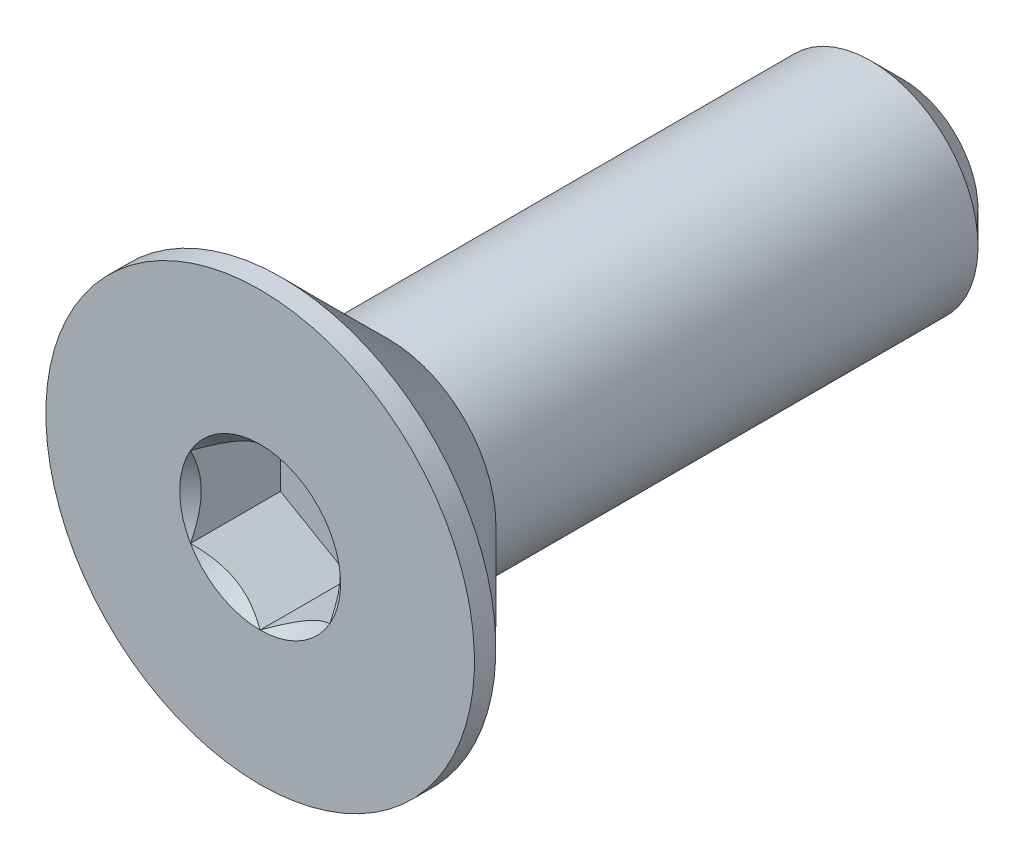
ISO-10303-21;
HEADER;
FILE_DESCRIPTION(('STEP AP214'),'2;1');
FILE_NAME('part.step','',(''),(''),'','','');
FILE_SCHEMA(('AUTOMOTIVE_DESIGN { 1 0 10303 214 1 1 1 1 }'));
ENDSEC;
DATA;
#1=APPLICATION_CONTEXT('core data for automotive mechanical design processes');
#2=APPLICATION_PROTOCOL_DEFINITION('international standard','automotive_design',2000,#1);
#3=PRODUCT_CONTEXT('',#1,'mechanical');
#4=PRODUCT('Part','Part','',(#3));
#5=PRODUCT_RELATED_PRODUCT_CATEGORY('part','',(#4));
#6=PRODUCT_DEFINITION_FORMATION('','',#4);
#7=PRODUCT_DEFINITION_CONTEXT('part definition',#1,'design');
#8=PRODUCT_DEFINITION('design','',#6,#7);
#9=PRODUCT_DEFINITION_SHAPE('','',#8);
#10=(LENGTH_UNIT() NAMED_UNIT(*) SI_UNIT(.MILLI.,.METRE.));
#11=(NAMED_UNIT(*) PLANE_ANGLE_UNIT() SI_UNIT($,.RADIAN.));
#12=(NAMED_UNIT(*) SI_UNIT($,.STERADIAN.) SOLID_ANGLE_UNIT());
#13=UNCERTAINTY_MEASURE_WITH_UNIT(LENGTH_MEASURE(1.E-05),#10,'distance_accuracy_value','');
#14=(GEOMETRIC_REPRESENTATION_CONTEXT(3) GLOBAL_UNCERTAINTY_ASSIGNED_CONTEXT((#13)) GLOBAL_UNIT_ASSIGNED_CONTEXT((#10,
#11,#12)) REPRESENTATION_CONTEXT('',''));
#15=CARTESIAN_POINT('',(0.,0.,0.));
#16=DIRECTION('',(0.,0.,1.));
#17=DIRECTION('',(1.,0.,0.));
#18=AXIS2_PLACEMENT_3D('',#15,#16,#17);
#19=CARTESIAN_POINT('',(0.,0.,-6.));
#20=DIRECTION('',(0.,0.,-1.));
#21=DIRECTION('',(0.,1.,0.));
#22=AXIS2_PLACEMENT_3D('',#19,#20,#21);
#23=CYLINDRICAL_SURFACE('',#22,0.999999999999998);
#24=CARTESIAN_POINT('',(0.,0.,-5.7));
#25=DIRECTION('',(0.,0.,-1.));
#26=DIRECTION('',(0.,1.,0.));
#27=AXIS2_PLACEMENT_3D('',#24,#25,#26);
#28=CIRCLE('',#27,0.999999999999998);
#29=CARTESIAN_POINT('',(0.,0.999999999999997,-5.7));
#30=VERTEX_POINT('',#29);
#31=EDGE_CURVE('E48',#30,#30,#28,.F.);
#32=ORIENTED_EDGE('',*,*,#31,.T.);
#33=EDGE_LOOP('',(#32));
#34=FACE_BOUND('',#33,.T.);
#35=CARTESIAN_POINT('',(0.,0.,-1.19999999999999));
#36=DIRECTION('',(0.,0.,1.));
#37=DIRECTION('',(0.,-1.,0.));
#38=AXIS2_PLACEMENT_3D('',#35,#36,#37);
#39=CIRCLE('',#38,1.00000000000001);
#40=CARTESIAN_POINT('',(0.,-1.00000000000001,-1.19999999999999));
#41=VERTEX_POINT('',#40);
#42=EDGE_CURVE('E166',#41,#41,#39,.T.);
#43=ORIENTED_EDGE('',*,*,#42,.F.);
#44=EDGE_LOOP('',(#43));
#45=FACE_BOUND('',#44,.T.);
#46=ADVANCED_FACE('F35',(#34,#45),#23,.T.);
#47=CARTESIAN_POINT('',(0.,-1.,-6.));
#48=DIRECTION('',(0.,0.,-1.));
#49=DIRECTION('',(0.,1.,0.));
#50=AXIS2_PLACEMENT_3D('',#47,#48,#49);
#51=PLANE('',#50);
#52=CARTESIAN_POINT('',(0.,0.,-6.));
#53=DIRECTION('',(0.,0.,-1.));
#54=DIRECTION('',(0.,1.,0.));
#55=AXIS2_PLACEMENT_3D('',#52,#53,#54);
#56=CIRCLE('',#55,0.700000000000001);
#57=CARTESIAN_POINT('',(0.,0.700000000000001,-6.));
#58=VERTEX_POINT('',#57);
#59=EDGE_CURVE('E175',#58,#58,#56,.T.);
#60=ORIENTED_EDGE('',*,*,#59,.T.);
#61=EDGE_LOOP('',(#60));
#62=FACE_BOUND('',#61,.T.);
#63=ADVANCED_FACE('F185',(#62),#51,.T.);
#64=CARTESIAN_POINT('',(0.,0.,-6.));
#65=DIRECTION('',(0.,0.,1.));
#66=DIRECTION('',(0.,-1.,0.));
#67=AXIS2_PLACEMENT_3D('',#64,#65,#66);
#68=CONICAL_SURFACE('',#67,0.700000000000001,0.785398163397446);
#69=ORIENTED_EDGE('',*,*,#31,.F.);
#70=EDGE_LOOP('',(#69));
#71=FACE_BOUND('',#70,.T.);
#72=ORIENTED_EDGE('',*,*,#59,.F.);
#73=EDGE_LOOP('',(#72));
#74=FACE_BOUND('',#73,.T.);
#75=ADVANCED_FACE('F37',(#71,#74),#68,.T.);
#76=CARTESIAN_POINT('',(0.,0.,0.));
#77=DIRECTION('',(0.,0.,1.));
#78=DIRECTION('',(0.,-1.,0.));
#79=AXIS2_PLACEMENT_3D('',#76,#77,#78);
#80=CYLINDRICAL_SURFACE('',#79,2.);
#81=CARTESIAN_POINT('',(0.,0.,0.));
#82=DIRECTION('',(0.,0.,1.));
#83=DIRECTION('',(0.,-1.,0.));
#84=AXIS2_PLACEMENT_3D('',#81,#82,#83);
#85=CIRCLE('',#84,1.99999999999999);
#86=CARTESIAN_POINT('',(0.,-1.99999999999999,0.));
#87=VERTEX_POINT('',#86);
#88=EDGE_CURVE('E172',#87,#87,#85,.T.);
#89=ORIENTED_EDGE('',*,*,#88,.F.);
#90=EDGE_LOOP('',(#89));
#91=FACE_BOUND('',#90,.T.);
#92=CARTESIAN_POINT('',(0.,0.,-0.199999999999994));
#93=DIRECTION('',(0.,0.,1.));
#94=DIRECTION('',(0.,-1.,0.));
#95=AXIS2_PLACEMENT_3D('',#92,#93,#94);
#96=CIRCLE('',#95,2.);
#97=CARTESIAN_POINT('',(0.,-2.,-0.199999999999984));
#98=VERTEX_POINT('',#97);
#99=EDGE_CURVE('E169',#98,#98,#96,.T.);
#100=ORIENTED_EDGE('',*,*,#99,.T.);
#101=EDGE_LOOP('',(#100));
#102=FACE_BOUND('',#101,.T.);
#103=ADVANCED_FACE('F184',(#91,#102),#80,.T.);
#104=CARTESIAN_POINT('',(0.,0.,-1.19999999999999));
#105=DIRECTION('',(0.,0.,1.));
#106=DIRECTION('',(0.,-1.,0.));
#107=AXIS2_PLACEMENT_3D('',#104,#105,#106);
#108=CONICAL_SURFACE('',#107,1.00000000000001,0.785398163397445);
#109=ORIENTED_EDGE('',*,*,#99,.F.);
#110=EDGE_LOOP('',(#109));
#111=FACE_BOUND('',#110,.T.);
#112=ORIENTED_EDGE('',*,*,#42,.T.);
#113=EDGE_LOOP('',(#112));
#114=FACE_BOUND('',#113,.T.);
#115=ADVANCED_FACE('F195',(#111,#114),#108,.T.);
#116=CARTESIAN_POINT('',(0.,-0.999999999999995,0.));
#117=DIRECTION('',(0.,0.,1.));
#118=DIRECTION('',(0.,-1.,0.));
#119=AXIS2_PLACEMENT_3D('',#116,#117,#118);
#120=PLANE('',#119);
#121=CARTESIAN_POINT('',(0.,0.,0.));
#122=DIRECTION('',(0.,0.,1.));
#123=DIRECTION('',(1.,0.,0.));
#124=AXIS2_PLACEMENT_3D('',#121,#122,#123);
#125=CIRCLE('',#124,0.750555349946514);
#126=CARTESIAN_POINT('',(0.,-0.750555349946514,0.));
#127=VERTEX_POINT('',#126);
#128=CARTESIAN_POINT('',(0.649999999999999,-0.375277674973259,0.));
#129=VERTEX_POINT('',#128);
#130=EDGE_CURVE('E94',#127,#129,#125,.T.);
#131=ORIENTED_EDGE('',*,*,#130,.F.);
#132=CARTESIAN_POINT('',(-0.65,-0.375277674973256,0.));
#133=VERTEX_POINT('',#132);
#134=EDGE_CURVE('E54',#133,#127,#125,.T.);
#135=ORIENTED_EDGE('',*,*,#134,.F.);
#136=CARTESIAN_POINT('',(-0.65,0.375277674973257,0.));
#137=VERTEX_POINT('',#136);
#138=EDGE_CURVE('E136',#137,#133,#125,.T.);
#139=ORIENTED_EDGE('',*,*,#138,.F.);
#140=CARTESIAN_POINT('',(0.,0.750555349946514,0.));
#141=VERTEX_POINT('',#140);
#142=EDGE_CURVE('E61',#141,#137,#125,.T.);
#143=ORIENTED_EDGE('',*,*,#142,.F.);
#144=CARTESIAN_POINT('',(0.65,0.375277674973259,0.));
#145=VERTEX_POINT('',#144);
#146=EDGE_CURVE('E130',#145,#141,#125,.T.);
#147=ORIENTED_EDGE('',*,*,#146,.F.);
#148=EDGE_CURVE('E102',#129,#145,#125,.T.);
#149=ORIENTED_EDGE('',*,*,#148,.F.);
#150=EDGE_LOOP('',(#131,#135,#139,#143,#147,#149));
#151=FACE_BOUND('',#150,.T.);
#152=ORIENTED_EDGE('',*,*,#88,.T.);
#153=EDGE_LOOP('',(#152));
#154=FACE_BOUND('',#153,.T.);
#155=ADVANCED_FACE('F128',(#151,#154),#120,.T.);
#156=CARTESIAN_POINT('',(0.,0.,0.));
#157=DIRECTION('',(0.,0.,1.));
#158=DIRECTION('',(1.,0.,0.));
#159=AXIS2_PLACEMENT_3D('',#156,#157,#158);
#160=CONICAL_SURFACE('',#159,0.750555349946514,0.78539816339745);
#161=ORIENTED_EDGE('',*,*,#148,.T.);
#162=CARTESIAN_POINT('',(0.649999999999999,-0.748456856202001,0.240750690384009));
#163=CARTESIAN_POINT('',(0.649999999999999,-0.711991073878824,0.213280285933624));
#164=CARTESIAN_POINT('',(0.649999999999999,-0.675139640082802,0.186265195476197));
#165=CARTESIAN_POINT('',(0.649999999999999,-0.600031183452826,0.133629348283165));
#166=CARTESIAN_POINT('',(0.649999999999999,-0.5617654412709,0.108021106129099));
#167=CARTESIAN_POINT('',(0.649999999999999,-0.481525479406325,0.0577374937624623));
#168=CARTESIAN_POINT('',(0.649999999999999,-0.43946425367049,0.0331988021987563));
#169=CARTESIAN_POINT('',(0.649999999999999,-0.353242719412722,-0.0116853403013642));
#170=CARTESIAN_POINT('',(0.649999999999999,-0.309090130602528,-0.0320449275105121));
#171=CARTESIAN_POINT('',(0.649999999999999,-0.242810057498672,-0.0569512709113486));
#172=CARTESIAN_POINT('',(0.649999999999999,-0.221667349821691,-0.0640992725852885));
#173=CARTESIAN_POINT('',(0.649999999999999,-0.178882845085544,-0.076702470547455));
#174=CARTESIAN_POINT('',(0.649999999999999,-0.157241013753965,-0.0821575502168753));
#175=CARTESIAN_POINT('',(0.649999999999999,-0.0924732258239357,-0.0953392346897772));
#176=CARTESIAN_POINT('',(0.649999999999999,-0.0486986201802788,-0.100206440230562));
#177=CARTESIAN_POINT('',(0.649999999999999,0.0373331587621226,-0.100855510769223));
#178=CARTESIAN_POINT('',(0.65,0.0795879418799254,-0.0969596606801959));
#179=CARTESIAN_POINT('',(0.65,0.142230570834974,-0.0855076744021686));
#180=CARTESIAN_POINT('',(0.65,0.163174856664668,-0.0806854357632721));
#181=CARTESIAN_POINT('',(0.65,0.204615212735412,-0.0693999000452593));
#182=CARTESIAN_POINT('',(0.65,0.225111320324616,-0.0629367402798584));
#183=CARTESIAN_POINT('',(0.65,0.289638534772369,-0.0401559078683602));
#184=CARTESIAN_POINT('',(0.65,0.332748206875049,-0.0212427548658019));
#185=CARTESIAN_POINT('',(0.65,0.416943840013232,0.0208112818887771));
#186=CARTESIAN_POINT('',(0.65,0.458021834530768,0.0439673547577746));
#187=CARTESIAN_POINT('',(0.65,0.536529233245988,0.091726639718087));
#188=CARTESIAN_POINT('',(0.65,0.57403850913462,0.116200758127151));
#189=CARTESIAN_POINT('',(0.65,0.647609691485455,0.166623456014881));
#190=CARTESIAN_POINT('',(0.65,0.683680924535917,0.192558343655286));
#191=CARTESIAN_POINT('',(0.65,0.719356204751139,0.218966877397429));
#192=B_SPLINE_CURVE_WITH_KNOTS('',3,(#162,#163,#164,#165,#166,#167,#168,#169,#170,#171,#172,
#173,#174,#175,#176,#177,#178,#179,#180,#181,#182,#183,#184,#185,#186,#187,#188,#189,#190,#191),
.UNSPECIFIED.,.F.,.F.,(4,2,2,2,2,2,2,2,2,2,2,2,2,2,4),(0.,0.13701403000958,0.275096405762554,
0.421060359835526,0.566522128775096,0.633415056462923,0.700312591121807,0.831534924508342,
0.958010408789905,1.02242898521266,1.08684217280829,1.22766018796413,1.36899252873704,
1.50330165960873,1.63651263433843),.UNSPECIFIED.);
#193=EDGE_CURVE('E11',#129,#145,#192,.T.);
#194=ORIENTED_EDGE('',*,*,#193,.F.);
#195=EDGE_LOOP('',(#161,#194));
#196=FACE_BOUND('',#195,.T.);
#197=ADVANCED_FACE('F106',(#196),#160,.F.);
#198=ORIENTED_EDGE('',*,*,#146,.T.);
#199=CARTESIAN_POINT('',(0.6502,0.37516220491942,0.000115496696673458));
#200=CARTESIAN_POINT('',(0.627846124557379,0.388068220923648,-0.0127826378084543));
#201=CARTESIAN_POINT('',(0.605119879467387,0.401189224644024,-0.0249248451013638));
#202=CARTESIAN_POINT('',(0.558778015356717,0.427944712363069,-0.0471577551377742));
#203=CARTESIAN_POINT('',(0.535157980959403,0.441581745580626,-0.0572360751899936));
#204=CARTESIAN_POINT('',(0.487526191293144,0.469081972166424,-0.0744984835766256));
#205=CARTESIAN_POINT('',(0.463526635406914,0.482938122217771,-0.081726041484421));
#206=CARTESIAN_POINT('',(0.415010589754791,0.51094887423504,-0.0928707979999935));
#207=CARTESIAN_POINT('',(0.390495555958119,0.525102635596742,-0.0967962973781322));
#208=CARTESIAN_POINT('',(0.33061559766408,0.559674345636868,-0.101776562665293));
#209=CARTESIAN_POINT('',(0.295110807096765,0.580173046028429,-0.100875515207342));
#210=CARTESIAN_POINT('',(0.224845447682006,0.620740770201246,-0.0915914386833312));
#211=CARTESIAN_POINT('',(0.190086069560698,0.640809106516447,-0.0831972369703435));
#212=CARTESIAN_POINT('',(0.129041737491061,0.676053068069353,-0.0629543214927022));
#213=CARTESIAN_POINT('',(0.102476138584915,0.691390723749,-0.0521615767354974));
#214=CARTESIAN_POINT('',(0.0503858451009331,0.721465068714143,-0.0278480685503982));
#215=CARTESIAN_POINT('',(0.024858081174964,0.736203530088611,-0.0143361789927107));
#216=CARTESIAN_POINT('',(-0.000200000000000232,0.750670820000352,0.000115496696674045));
#217=B_SPLINE_CURVE_WITH_KNOTS('',3,(#199,#200,#201,#202,#203,#204,#205,#206,#207,#208,#209,
#210,#211,#212,#213,#214,#215,#216),.UNSPECIFIED.,.F.,.F.,(4,2,2,2,2,2,2,2,4),(0.,
0.0866236559063443,0.173752711623242,0.259496442803568,0.345023980281752,0.467267720550125,
0.589694037029335,0.68711130875548,0.784215671813665),.UNSPECIFIED.);
#218=EDGE_CURVE('E132',#145,#141,#217,.T.);
#219=ORIENTED_EDGE('',*,*,#218,.F.);
#220=EDGE_LOOP('',(#198,#219));
#221=FACE_BOUND('',#220,.T.);
#222=ADVANCED_FACE('F271',(#221),#160,.F.);
#223=ORIENTED_EDGE('',*,*,#142,.T.);
#224=CARTESIAN_POINT('',(0.0001999999999998,0.750670820000352,0.000115496696674086));
#225=CARTESIAN_POINT('',(-0.0221538754426208,0.737764803996124,-0.0127826378084538));
#226=CARTESIAN_POINT('',(-0.0448801205326128,0.724643800275747,-0.0249248451013632));
#227=CARTESIAN_POINT('',(-0.0912219846432827,0.697888312556703,-0.0471577551377738));
#228=CARTESIAN_POINT('',(-0.114842019040597,0.684251279339146,-0.0572360751899932));
#229=CARTESIAN_POINT('',(-0.162473808706856,0.656751052753347,-0.0744984835766253));
#230=CARTESIAN_POINT('',(-0.186473364593086,0.642894902702001,-0.0817260414844208));
#231=CARTESIAN_POINT('',(-0.23498941024521,0.614884150684731,-0.0928707979999933));
#232=CARTESIAN_POINT('',(-0.259504444041881,0.60073038932303,-0.0967962973781321));
#233=CARTESIAN_POINT('',(-0.31938440233592,0.566158679282903,-0.101776562665293));
#234=CARTESIAN_POINT('',(-0.354889192903236,0.545659978891342,-0.100875515207342));
#235=CARTESIAN_POINT('',(-0.425154552317995,0.505092254718525,-0.0915914386833311));
#236=CARTESIAN_POINT('',(-0.459913930439302,0.485023918403324,-0.0831972369703433));
#237=CARTESIAN_POINT('',(-0.52095826250894,0.449779956850418,-0.0629543214927021));
#238=CARTESIAN_POINT('',(-0.547523861415086,0.434442301170771,-0.0521615767354973));
#239=CARTESIAN_POINT('',(-0.599614154899067,0.404367956205628,-0.0278480685503983));
#240=CARTESIAN_POINT('',(-0.625141918825036,0.38962949483116,-0.0143361789927108));
#241=CARTESIAN_POINT('',(-0.6502,0.375162204919419,0.000115496696673951));
#242=B_SPLINE_CURVE_WITH_KNOTS('',3,(#224,#225,#226,#227,#228,#229,#230,#231,#232,#233,#234,
#235,#236,#237,#238,#239,#240,#241),.UNSPECIFIED.,.F.,.F.,(4,2,2,2,2,2,2,2,4),(0.,
0.0866236559063444,0.173752711623242,0.259496442803568,0.345023980281753,0.467267720550126,
0.589694037029337,0.687111308755481,0.784215671813666),.UNSPECIFIED.);
#243=EDGE_CURVE('E135',#141,#137,#242,.T.);
#244=ORIENTED_EDGE('',*,*,#243,.F.);
#245=EDGE_LOOP('',(#223,#244));
#246=FACE_BOUND('',#245,.T.);
#247=ADVANCED_FACE('F267',(#246),#160,.F.);
#248=ORIENTED_EDGE('',*,*,#138,.T.);
#249=CARTESIAN_POINT('',(-0.65,-0.748456856202,0.240750690384009));
#250=CARTESIAN_POINT('',(-0.65,-0.711991073878823,0.213280285933624));
#251=CARTESIAN_POINT('',(-0.65,-0.675139640082801,0.186265195476196));
#252=CARTESIAN_POINT('',(-0.65,-0.600031183452825,0.133629348283165));
#253=CARTESIAN_POINT('',(-0.65,-0.561765441270899,0.108021106129099));
#254=CARTESIAN_POINT('',(-0.65,-0.481525479406325,0.0577374937624624));
#255=CARTESIAN_POINT('',(-0.65,-0.439464253670489,0.0331988021987566));
#256=CARTESIAN_POINT('',(-0.65,-0.353242719412722,-0.0116853403013638));
#257=CARTESIAN_POINT('',(-0.65,-0.309090130602527,-0.0320449275105118));
#258=CARTESIAN_POINT('',(-0.65,-0.242810057498671,-0.0569512709113481));
#259=CARTESIAN_POINT('',(-0.65,-0.22166734982169,-0.0640992725852878));
#260=CARTESIAN_POINT('',(-0.65,-0.178882845085544,-0.0767024705474542));
#261=CARTESIAN_POINT('',(-0.65,-0.157241013753965,-0.0821575502168746));
#262=CARTESIAN_POINT('',(-0.65,-0.0924732258239351,-0.0953392346897765));
#263=CARTESIAN_POINT('',(-0.65,-0.0486986201802782,-0.100206440230561));
#264=CARTESIAN_POINT('',(-0.65,0.0373331587621233,-0.100855510769222));
#265=CARTESIAN_POINT('',(-0.65,0.0795879418799262,-0.096959660680195));
#266=CARTESIAN_POINT('',(-0.65,0.142230570834975,-0.0855076744021676));
#267=CARTESIAN_POINT('',(-0.65,0.163174856664668,-0.0806854357632711));
#268=CARTESIAN_POINT('',(-0.65,0.204615212735413,-0.0693999000452582));
#269=CARTESIAN_POINT('',(-0.65,0.225111320324616,-0.0629367402798573));
#270=CARTESIAN_POINT('',(-0.65,0.28963853477237,-0.0401559078683591));
#271=CARTESIAN_POINT('',(-0.65,0.33274820687505,-0.0212427548658007));
#272=CARTESIAN_POINT('',(-0.65,0.416943840013233,0.0208112818887785));
#273=CARTESIAN_POINT('',(-0.65,0.458021834530769,0.043967354757776));
#274=CARTESIAN_POINT('',(-0.65,0.536529233245989,0.0917266397180885));
#275=CARTESIAN_POINT('',(-0.65,0.574038509134621,0.116200758127153));
#276=CARTESIAN_POINT('',(-0.65,0.647609691485456,0.166623456014883));
#277=CARTESIAN_POINT('',(-0.65,0.683680924535919,0.192558343655288));
#278=CARTESIAN_POINT('',(-0.65,0.719356204751141,0.218966877397431));
#279=B_SPLINE_CURVE_WITH_KNOTS('',3,(#249,#250,#251,#252,#253,#254,#255,#256,#257,#258,#259,
#260,#261,#262,#263,#264,#265,#266,#267,#268,#269,#270,#271,#272,#273,#274,#275,#276,#277,#278),
.UNSPECIFIED.,.F.,.F.,(4,2,2,2,2,2,2,2,2,2,2,2,2,2,4),(0.,0.13701403000958,0.275096405762554,
0.421060359835526,0.566522128775095,0.633415056462922,0.700312591121806,0.831534924508341,
0.958010408789904,1.02242898521266,1.08684217280829,1.22766018796413,1.36899252873704,
1.50330165960874,1.63651263433843),.UNSPECIFIED.);
#280=EDGE_CURVE('E142',#137,#133,#279,.F.);
#281=ORIENTED_EDGE('',*,*,#280,.F.);
#282=EDGE_LOOP('',(#248,#281));
#283=FACE_BOUND('',#282,.T.);
#284=ADVANCED_FACE('F140',(#283),#160,.F.);
#285=ORIENTED_EDGE('',*,*,#134,.T.);
#286=CARTESIAN_POINT('',(-0.6502,-0.375162204919418,0.000115496696673349));
#287=CARTESIAN_POINT('',(-0.62784612455738,-0.388068220923647,-0.0127826378084544));
#288=CARTESIAN_POINT('',(-0.605119879467388,-0.401189224644023,-0.0249248451013639));
#289=CARTESIAN_POINT('',(-0.558778015356718,-0.427944712363067,-0.0471577551377745));
#290=CARTESIAN_POINT('',(-0.535157980959404,-0.441581745580625,-0.057236075189994));
#291=CARTESIAN_POINT('',(-0.487526191293144,-0.469081972166423,-0.0744984835766262));
#292=CARTESIAN_POINT('',(-0.463526635406914,-0.48293812221777,-0.0817260414844217));
#293=CARTESIAN_POINT('',(-0.415010589754791,-0.510948874235039,-0.0928707979999942));
#294=CARTESIAN_POINT('',(-0.390495555958119,-0.525102635596741,-0.096796297378133));
#295=CARTESIAN_POINT('',(-0.33061559766408,-0.559674345636868,-0.101776562665294));
#296=CARTESIAN_POINT('',(-0.295110807096765,-0.580173046028428,-0.100875515207343));
#297=CARTESIAN_POINT('',(-0.224845447682006,-0.620740770201245,-0.091591438683332));
#298=CARTESIAN_POINT('',(-0.190086069560699,-0.640809106516446,-0.0831972369703444));
#299=CARTESIAN_POINT('',(-0.129041737491061,-0.676053068069352,-0.0629543214927031));
#300=CARTESIAN_POINT('',(-0.102476138584915,-0.691390723748999,-0.0521615767354983));
#301=CARTESIAN_POINT('',(-0.0503858451009336,-0.721465068714142,-0.0278480685503992));
#302=CARTESIAN_POINT('',(-0.0248580811749646,-0.73620353008861,-0.0143361789927117));
#303=CARTESIAN_POINT('',(0.000199999999999682,-0.750670820000351,0.000115496696672961));
#304=B_SPLINE_CURVE_WITH_KNOTS('',3,(#286,#287,#288,#289,#290,#291,#292,#293,#294,#295,#296,
#297,#298,#299,#300,#301,#302,#303),.UNSPECIFIED.,.F.,.F.,(4,2,2,2,2,2,2,2,4),(0.,
0.0866236559063445,0.173752711623243,0.259496442803569,0.345023980281753,0.467267720550126,
0.589694037029336,0.687111308755481,0.784215671813666),.UNSPECIFIED.);
#305=EDGE_CURVE('E118',#133,#127,#304,.T.);
#306=ORIENTED_EDGE('',*,*,#305,.F.);
#307=EDGE_LOOP('',(#285,#306));
#308=FACE_BOUND('',#307,.T.);
#309=ADVANCED_FACE('F222',(#308),#160,.F.);
#310=ORIENTED_EDGE('',*,*,#130,.T.);
#311=CARTESIAN_POINT('',(-0.000200000000000307,-0.750670820000351,0.000115496696673002));
#312=CARTESIAN_POINT('',(0.0221538754426203,-0.737764803996123,-0.0127826378084549));
#313=CARTESIAN_POINT('',(0.0448801205326123,-0.724643800275746,-0.0249248451013644));
#314=CARTESIAN_POINT('',(0.0912219846432822,-0.697888312556702,-0.0471577551377749));
#315=CARTESIAN_POINT('',(0.114842019040596,-0.684251279339145,-0.0572360751899943));
#316=CARTESIAN_POINT('',(0.162473808706856,-0.656751052753346,-0.0744984835766264));
#317=CARTESIAN_POINT('',(0.186473364593086,-0.642894902702,-0.0817260414844219));
#318=CARTESIAN_POINT('',(0.234989410245209,-0.61488415068473,-0.0928707979999943));
#319=CARTESIAN_POINT('',(0.259504444041881,-0.600730389323029,-0.096796297378133));
#320=CARTESIAN_POINT('',(0.31938440233592,-0.566158679282902,-0.101776562665294));
#321=CARTESIAN_POINT('',(0.354889192903235,-0.545659978891341,-0.100875515207343));
#322=CARTESIAN_POINT('',(0.425154552317994,-0.505092254718524,-0.0915914386833321));
#323=CARTESIAN_POINT('',(0.459913930439301,-0.485023918403324,-0.0831972369703443));
#324=CARTESIAN_POINT('',(0.520958262508939,-0.449779956850417,-0.062954321492703));
#325=CARTESIAN_POINT('',(0.547523861415085,-0.434442301170771,-0.0521615767354983));
#326=CARTESIAN_POINT('',(0.599614154899066,-0.404367956205627,-0.0278480685503993));
#327=CARTESIAN_POINT('',(0.625141918825035,-0.38962949483116,-0.0143361789927119));
#328=CARTESIAN_POINT('',(0.650199999999999,-0.375162204919419,0.000115496696672908));
#329=B_SPLINE_CURVE_WITH_KNOTS('',3,(#311,#312,#313,#314,#315,#316,#317,#318,#319,#320,#321,
#322,#323,#324,#325,#326,#327,#328),.UNSPECIFIED.,.F.,.F.,(4,2,2,2,2,2,2,2,4),(0.,
0.0866236559063445,0.173752711623243,0.259496442803568,0.345023980281753,0.467267720550125,
0.589694037029336,0.687111308755481,0.784215671813665),.UNSPECIFIED.);
#330=EDGE_CURVE('E98',#127,#129,#329,.T.);
#331=ORIENTED_EDGE('',*,*,#330,.F.);
#332=EDGE_LOOP('',(#310,#331));
#333=FACE_BOUND('',#332,.T.);
#334=ADVANCED_FACE('F96',(#333),#160,.F.);
#335=CARTESIAN_POINT('',(0.649999999999999,-0.375277674973257,-0.84));
#336=DIRECTION('',(0.,0.,1.));
#337=DIRECTION('',(1.,0.,0.));
#338=AXIS2_PLACEMENT_3D('',#335,#336,#337);
#339=PLANE('',#338);
#340=DIRECTION('',(0.866025403784439,0.5,0.));
#341=VECTOR('',#340,1.);
#342=CARTESIAN_POINT('',(0.,-0.750555349946513,-0.84));
#343=LINE('',#342,#341);
#344=CARTESIAN_POINT('',(0.,-0.750555349946513,-0.84));
#345=VERTEX_POINT('',#344);
#346=CARTESIAN_POINT('',(0.649999999999999,-0.375277674973257,-0.84));
#347=VERTEX_POINT('',#346);
#348=EDGE_CURVE('E117',#345,#347,#343,.T.);
#349=ORIENTED_EDGE('',*,*,#348,.T.);
#350=DIRECTION('',(0.,1.,0.));
#351=VECTOR('',#350,1.);
#352=CARTESIAN_POINT('',(0.649999999999999,-0.375277674973257,-0.84));
#353=LINE('',#352,#351);
#354=CARTESIAN_POINT('',(0.65,0.375277674973258,-0.84));
#355=VERTEX_POINT('',#354);
#356=EDGE_CURVE('E122',#347,#355,#353,.T.);
#357=ORIENTED_EDGE('',*,*,#356,.T.);
#358=DIRECTION('',(-0.866025403784439,0.5,0.));
#359=VECTOR('',#358,1.);
#360=CARTESIAN_POINT('',(0.65,0.375277674973258,-0.84));
#361=LINE('',#360,#359);
#362=CARTESIAN_POINT('',(0.,0.750555349946514,-0.84));
#363=VERTEX_POINT('',#362);
#364=EDGE_CURVE('E253',#355,#363,#361,.T.);
#365=ORIENTED_EDGE('',*,*,#364,.T.);
#366=DIRECTION('',(-0.866025403784439,-0.5,0.));
#367=VECTOR('',#366,1.);
#368=CARTESIAN_POINT('',(0.,0.750555349946514,-0.84));
#369=LINE('',#368,#367);
#370=CARTESIAN_POINT('',(-0.65,0.375277674973257,-0.84));
#371=VERTEX_POINT('',#370);
#372=EDGE_CURVE('E255',#363,#371,#369,.T.);
#373=ORIENTED_EDGE('',*,*,#372,.T.);
#374=DIRECTION('',(0.,-1.,0.));
#375=VECTOR('',#374,1.);
#376=CARTESIAN_POINT('',(-0.65,0.375277674973257,-0.84));
#377=LINE('',#376,#375);
#378=CARTESIAN_POINT('',(-0.65,-0.375277674973256,-0.84));
#379=VERTEX_POINT('',#378);
#380=EDGE_CURVE('E157',#371,#379,#377,.T.);
#381=ORIENTED_EDGE('',*,*,#380,.T.);
#382=DIRECTION('',(0.866025403784439,-0.5,0.));
#383=VECTOR('',#382,1.);
#384=CARTESIAN_POINT('',(-0.65,-0.375277674973256,-0.84));
#385=LINE('',#384,#383);
#386=EDGE_CURVE('E125',#379,#345,#385,.T.);
#387=ORIENTED_EDGE('',*,*,#386,.T.);
#388=EDGE_LOOP('',(#349,#357,#365,#373,#381,#387));
#389=FACE_BOUND('',#388,.T.);
#390=ADVANCED_FACE('F221',(#389),#339,.T.);
#391=CARTESIAN_POINT('',(0.649999999999999,-0.375277674973257,-0.84));
#392=DIRECTION('',(1.,0.,0.));
#393=DIRECTION('',(0.,1.,0.));
#394=AXIS2_PLACEMENT_3D('',#391,#392,#393);
#395=PLANE('',#394);
#396=DIRECTION('',(0.,0.,1.));
#397=VECTOR('',#396,1.);
#398=CARTESIAN_POINT('',(0.649999999999999,-0.375277674973257,-0.84));
#399=LINE('',#398,#397);
#400=EDGE_CURVE('E114',#347,#129,#399,.T.);
#401=ORIENTED_EDGE('',*,*,#400,.T.);
#402=ORIENTED_EDGE('',*,*,#193,.T.);
#403=DIRECTION('',(0.,0.,1.));
#404=VECTOR('',#403,1.);
#405=CARTESIAN_POINT('',(0.65,0.375277674973258,-0.84));
#406=LINE('',#405,#404);
#407=EDGE_CURVE('E124',#355,#145,#406,.T.);
#408=ORIENTED_EDGE('',*,*,#407,.F.);
#409=ORIENTED_EDGE('',*,*,#356,.F.);
#410=EDGE_LOOP('',(#401,#402,#408,#409));
#411=FACE_BOUND('',#410,.T.);
#412=ADVANCED_FACE('F120',(#411),#395,.F.);
#413=CARTESIAN_POINT('',(0.65,0.375277674973258,-0.84));
#414=DIRECTION('',(0.5,0.866025403784439,0.));
#415=DIRECTION('',(-0.866025403784439,0.5,0.));
#416=AXIS2_PLACEMENT_3D('',#413,#414,#415);
#417=PLANE('',#416);
#418=ORIENTED_EDGE('',*,*,#407,.T.);
#419=ORIENTED_EDGE('',*,*,#218,.T.);
#420=DIRECTION('',(0.,0.,1.));
#421=VECTOR('',#420,1.);
#422=CARTESIAN_POINT('',(0.,0.750555349946514,-0.84));
#423=LINE('',#422,#421);
#424=EDGE_CURVE('E153',#363,#141,#423,.T.);
#425=ORIENTED_EDGE('',*,*,#424,.F.);
#426=ORIENTED_EDGE('',*,*,#364,.F.);
#427=EDGE_LOOP('',(#418,#419,#425,#426));
#428=FACE_BOUND('',#427,.T.);
#429=ADVANCED_FACE('F244',(#428),#417,.F.);
#430=CARTESIAN_POINT('',(0.,0.750555349946514,-0.84));
#431=DIRECTION('',(-0.5,0.866025403784439,0.));
#432=DIRECTION('',(-0.866025403784439,-0.5,0.));
#433=AXIS2_PLACEMENT_3D('',#430,#431,#432);
#434=PLANE('',#433);
#435=ORIENTED_EDGE('',*,*,#424,.T.);
#436=ORIENTED_EDGE('',*,*,#243,.T.);
#437=DIRECTION('',(0.,0.,1.));
#438=VECTOR('',#437,1.);
#439=CARTESIAN_POINT('',(-0.65,0.375277674973257,-0.84));
#440=LINE('',#439,#438);
#441=EDGE_CURVE('E151',#371,#137,#440,.T.);
#442=ORIENTED_EDGE('',*,*,#441,.F.);
#443=ORIENTED_EDGE('',*,*,#372,.F.);
#444=EDGE_LOOP('',(#435,#436,#442,#443));
#445=FACE_BOUND('',#444,.T.);
#446=ADVANCED_FACE('F149',(#445),#434,.F.);
#447=CARTESIAN_POINT('',(-0.65,0.375277674973257,-0.84));
#448=DIRECTION('',(-1.,0.,0.));
#449=DIRECTION('',(0.,-1.,0.));
#450=AXIS2_PLACEMENT_3D('',#447,#448,#449);
#451=PLANE('',#450);
#452=ORIENTED_EDGE('',*,*,#441,.T.);
#453=ORIENTED_EDGE('',*,*,#280,.T.);
#454=DIRECTION('',(0.,0.,1.));
#455=VECTOR('',#454,1.);
#456=CARTESIAN_POINT('',(-0.65,-0.375277674973256,-0.84));
#457=LINE('',#456,#455);
#458=EDGE_CURVE('E159',#379,#133,#457,.T.);
#459=ORIENTED_EDGE('',*,*,#458,.F.);
#460=ORIENTED_EDGE('',*,*,#380,.F.);
#461=EDGE_LOOP('',(#452,#453,#459,#460));
#462=FACE_BOUND('',#461,.T.);
#463=ADVANCED_FACE('F155',(#462),#451,.F.);
#464=CARTESIAN_POINT('',(-0.65,-0.375277674973256,-0.84));
#465=DIRECTION('',(-0.5,-0.866025403784439,0.));
#466=DIRECTION('',(0.866025403784439,-0.5,0.));
#467=AXIS2_PLACEMENT_3D('',#464,#465,#466);
#468=PLANE('',#467);
#469=ORIENTED_EDGE('',*,*,#458,.T.);
#470=ORIENTED_EDGE('',*,*,#305,.T.);
#471=DIRECTION('',(0.,0.,1.));
#472=VECTOR('',#471,1.);
#473=CARTESIAN_POINT('',(0.,-0.750555349946513,-0.84));
#474=LINE('',#473,#472);
#475=EDGE_CURVE('E116',#345,#127,#474,.T.);
#476=ORIENTED_EDGE('',*,*,#475,.F.);
#477=ORIENTED_EDGE('',*,*,#386,.F.);
#478=EDGE_LOOP('',(#469,#470,#476,#477));
#479=FACE_BOUND('',#478,.T.);
#480=ADVANCED_FACE('F205',(#479),#468,.F.);
#481=CARTESIAN_POINT('',(0.,-0.750555349946513,-0.84));
#482=DIRECTION('',(0.5,-0.866025403784439,0.));
#483=DIRECTION('',(0.866025403784439,0.5,0.));
#484=AXIS2_PLACEMENT_3D('',#481,#482,#483);
#485=PLANE('',#484);
#486=ORIENTED_EDGE('',*,*,#475,.T.);
#487=ORIENTED_EDGE('',*,*,#330,.T.);
#488=ORIENTED_EDGE('',*,*,#400,.F.);
#489=ORIENTED_EDGE('',*,*,#348,.F.);
#490=EDGE_LOOP('',(#486,#487,#488,#489));
#491=FACE_BOUND('',#490,.T.);
#492=ADVANCED_FACE('F112',(#491),#485,.F.);
#493=CLOSED_SHELL('',(#46,#63,#75,#103,#115,#155,#197,#222,#247,#284,#309,#334,#390,#412,#429,
#446,#463,#480,#492));
#494=MANIFOLD_SOLID_BREP('B2',#493);
#495=ADVANCED_BREP_SHAPE_REPRESENTATION('',(#18,#494),#14);
#496=SHAPE_DEFINITION_REPRESENTATION(#9,#495);
ENDSEC;
END-ISO-10303-21;
